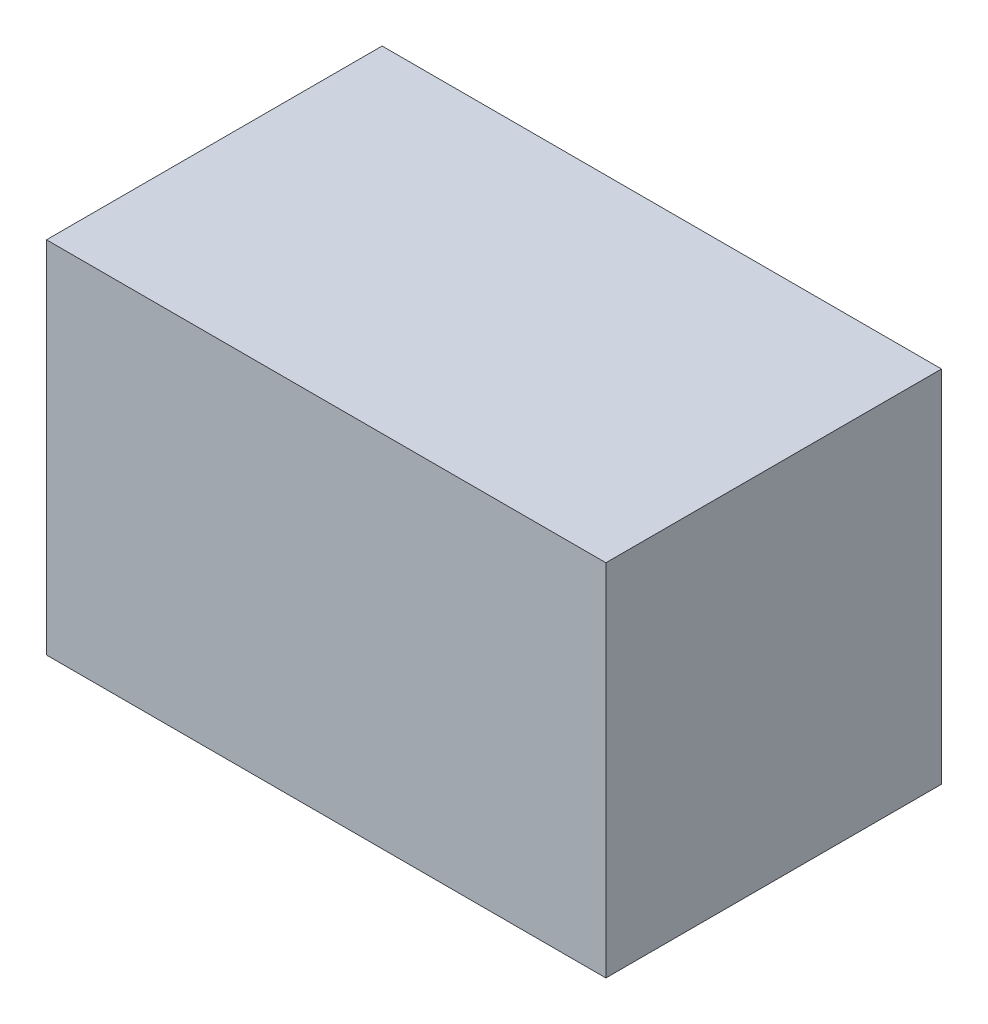
ISO-10303-21;
HEADER;
FILE_DESCRIPTION(('STEP AP214'),'2;1');
FILE_NAME('part.step','',(''),(''),'','','');
FILE_SCHEMA(('AUTOMOTIVE_DESIGN { 1 0 10303 214 1 1 1 1 }'));
ENDSEC;
DATA;
#1=APPLICATION_CONTEXT('core data for automotive mechanical design processes');
#2=APPLICATION_PROTOCOL_DEFINITION('international standard','automotive_design',2000,#1);
#3=PRODUCT_CONTEXT('',#1,'mechanical');
#4=PRODUCT('Part','Part','',(#3));
#5=PRODUCT_RELATED_PRODUCT_CATEGORY('part','',(#4));
#6=PRODUCT_DEFINITION_FORMATION('','',#4);
#7=PRODUCT_DEFINITION_CONTEXT('part definition',#1,'design');
#8=PRODUCT_DEFINITION('design','',#6,#7);
#9=PRODUCT_DEFINITION_SHAPE('','',#8);
#10=(LENGTH_UNIT() NAMED_UNIT(*) SI_UNIT(.MILLI.,.METRE.));
#11=(NAMED_UNIT(*) PLANE_ANGLE_UNIT() SI_UNIT($,.RADIAN.));
#12=(NAMED_UNIT(*) SI_UNIT($,.STERADIAN.) SOLID_ANGLE_UNIT());
#13=UNCERTAINTY_MEASURE_WITH_UNIT(LENGTH_MEASURE(1.E-05),#10,'distance_accuracy_value','');
#14=(GEOMETRIC_REPRESENTATION_CONTEXT(3) GLOBAL_UNCERTAINTY_ASSIGNED_CONTEXT((#13)) GLOBAL_UNIT_ASSIGNED_CONTEXT((#10,
#11,#12)) REPRESENTATION_CONTEXT('',''));
#15=CARTESIAN_POINT('',(0.,0.,0.));
#16=DIRECTION('',(0.,0.,1.));
#17=DIRECTION('',(1.,0.,0.));
#18=AXIS2_PLACEMENT_3D('',#15,#16,#17);
#19=CARTESIAN_POINT('',(-1.05000044,-0.67499992,1.26));
#20=DIRECTION('',(0.,0.,1.));
#21=DIRECTION('',(1.,0.,0.));
#22=AXIS2_PLACEMENT_3D('',#19,#20,#21);
#23=PLANE('',#22);
#24=DIRECTION('',(1.,0.,0.));
#25=VECTOR('',#24,1.);
#26=CARTESIAN_POINT('',(-1.05000044,0.67499992,1.26));
#27=LINE('',#26,#25);
#28=CARTESIAN_POINT('',(-1.05000044,0.67499992,1.26));
#29=VERTEX_POINT('',#28);
#30=CARTESIAN_POINT('',(1.05000044,0.67499992,1.26));
#31=VERTEX_POINT('',#30);
#32=EDGE_CURVE('E53',#29,#31,#27,.T.);
#33=ORIENTED_EDGE('',*,*,#32,.F.);
#34=DIRECTION('',(0.,1.,0.));
#35=VECTOR('',#34,1.);
#36=CARTESIAN_POINT('',(-1.05000044,-0.67499992,1.26));
#37=LINE('',#36,#35);
#38=CARTESIAN_POINT('',(-1.05000044,-0.67499992,1.26));
#39=VERTEX_POINT('',#38);
#40=EDGE_CURVE('E20',#29,#39,#37,.F.);
#41=ORIENTED_EDGE('',*,*,#40,.T.);
#42=DIRECTION('',(1.,0.,0.));
#43=VECTOR('',#42,1.);
#44=CARTESIAN_POINT('',(1.05000044,-0.67499992,1.26));
#45=LINE('',#44,#43);
#46=CARTESIAN_POINT('',(1.05000044,-0.67499992,1.26));
#47=VERTEX_POINT('',#46);
#48=EDGE_CURVE('E67',#47,#39,#45,.F.);
#49=ORIENTED_EDGE('',*,*,#48,.F.);
#50=DIRECTION('',(0.,1.,0.));
#51=VECTOR('',#50,1.);
#52=CARTESIAN_POINT('',(1.05000044,0.67499992,1.26));
#53=LINE('',#52,#51);
#54=EDGE_CURVE('E58',#31,#47,#53,.F.);
#55=ORIENTED_EDGE('',*,*,#54,.F.);
#56=EDGE_LOOP('',(#33,#41,#49,#55));
#57=FACE_BOUND('',#56,.T.);
#58=ADVANCED_FACE('F17',(#57),#23,.T.);
#59=CARTESIAN_POINT('',(1.05000044,-0.67499992,0.));
#60=DIRECTION('',(0.,-1.,0.));
#61=DIRECTION('',(0.,0.,-1.));
#62=AXIS2_PLACEMENT_3D('',#59,#60,#61);
#63=PLANE('',#62);
#64=DIRECTION('',(0.,0.,1.));
#65=VECTOR('',#64,1.);
#66=CARTESIAN_POINT('',(-1.05000044,-0.67499992,0.));
#67=LINE('',#66,#65);
#68=CARTESIAN_POINT('',(-1.05000044,-0.67499992,0.));
#69=VERTEX_POINT('',#68);
#70=EDGE_CURVE('E80',#69,#39,#67,.T.);
#71=ORIENTED_EDGE('',*,*,#70,.F.);
#72=DIRECTION('',(1.,0.,0.));
#73=VECTOR('',#72,1.);
#74=CARTESIAN_POINT('',(-1.05000044,-0.67499992,0.));
#75=LINE('',#74,#73);
#76=CARTESIAN_POINT('',(1.05000044,-0.67499992,0.));
#77=VERTEX_POINT('',#76);
#78=EDGE_CURVE('E75',#69,#77,#75,.T.);
#79=ORIENTED_EDGE('',*,*,#78,.T.);
#80=DIRECTION('',(0.,0.,-1.));
#81=VECTOR('',#80,1.);
#82=CARTESIAN_POINT('',(1.05000044,-0.67499992,0.));
#83=LINE('',#82,#81);
#84=EDGE_CURVE('E63',#47,#77,#83,.T.);
#85=ORIENTED_EDGE('',*,*,#84,.F.);
#86=ORIENTED_EDGE('',*,*,#48,.T.);
#87=EDGE_LOOP('',(#71,#79,#85,#86));
#88=FACE_BOUND('',#87,.T.);
#89=ADVANCED_FACE('F74',(#88),#63,.T.);
#90=CARTESIAN_POINT('',(1.05000044,0.67499992,0.));
#91=DIRECTION('',(1.,0.,0.));
#92=DIRECTION('',(0.,0.,-1.));
#93=AXIS2_PLACEMENT_3D('',#90,#91,#92);
#94=PLANE('',#93);
#95=ORIENTED_EDGE('',*,*,#84,.T.);
#96=DIRECTION('',(0.,1.,0.));
#97=VECTOR('',#96,1.);
#98=CARTESIAN_POINT('',(1.05000044,-0.67499992,0.));
#99=LINE('',#98,#97);
#100=CARTESIAN_POINT('',(1.05000044,0.67499992,0.));
#101=VERTEX_POINT('',#100);
#102=EDGE_CURVE('E84',#77,#101,#99,.T.);
#103=ORIENTED_EDGE('',*,*,#102,.T.);
#104=DIRECTION('',(0.,0.,1.));
#105=VECTOR('',#104,1.);
#106=CARTESIAN_POINT('',(1.05000044,0.67499992,0.));
#107=LINE('',#106,#105);
#108=EDGE_CURVE('E65',#31,#101,#107,.F.);
#109=ORIENTED_EDGE('',*,*,#108,.F.);
#110=ORIENTED_EDGE('',*,*,#54,.T.);
#111=EDGE_LOOP('',(#95,#103,#109,#110));
#112=FACE_BOUND('',#111,.T.);
#113=ADVANCED_FACE('F60',(#112),#94,.T.);
#114=CARTESIAN_POINT('',(-1.05000044,0.67499992,0.));
#115=DIRECTION('',(0.,1.,0.));
#116=DIRECTION('',(0.,0.,1.));
#117=AXIS2_PLACEMENT_3D('',#114,#115,#116);
#118=PLANE('',#117);
#119=ORIENTED_EDGE('',*,*,#108,.T.);
#120=DIRECTION('',(1.,0.,0.));
#121=VECTOR('',#120,1.);
#122=CARTESIAN_POINT('',(-1.05000044,0.67499992,0.));
#123=LINE('',#122,#121);
#124=CARTESIAN_POINT('',(-1.05000044,0.67499992,0.));
#125=VERTEX_POINT('',#124);
#126=EDGE_CURVE('E26',#101,#125,#123,.F.);
#127=ORIENTED_EDGE('',*,*,#126,.T.);
#128=DIRECTION('',(0.,0.,1.));
#129=VECTOR('',#128,1.);
#130=CARTESIAN_POINT('',(-1.05000044,0.67499992,0.));
#131=LINE('',#130,#129);
#132=EDGE_CURVE('E34',#29,#125,#131,.F.);
#133=ORIENTED_EDGE('',*,*,#132,.F.);
#134=ORIENTED_EDGE('',*,*,#32,.T.);
#135=EDGE_LOOP('',(#119,#127,#133,#134));
#136=FACE_BOUND('',#135,.T.);
#137=ADVANCED_FACE('F88',(#136),#118,.T.);
#138=CARTESIAN_POINT('',(-1.05000044,-0.67499992,0.));
#139=DIRECTION('',(-1.,0.,0.));
#140=DIRECTION('',(0.,0.,1.));
#141=AXIS2_PLACEMENT_3D('',#138,#139,#140);
#142=PLANE('',#141);
#143=ORIENTED_EDGE('',*,*,#132,.T.);
#144=DIRECTION('',(0.,1.,0.));
#145=VECTOR('',#144,1.);
#146=CARTESIAN_POINT('',(-1.05000044,-0.67499992,0.));
#147=LINE('',#146,#145);
#148=EDGE_CURVE('E11',#125,#69,#147,.F.);
#149=ORIENTED_EDGE('',*,*,#148,.T.);
#150=ORIENTED_EDGE('',*,*,#70,.T.);
#151=ORIENTED_EDGE('',*,*,#40,.F.);
#152=EDGE_LOOP('',(#143,#149,#150,#151));
#153=FACE_BOUND('',#152,.T.);
#154=ADVANCED_FACE('F91',(#153),#142,.T.);
#155=CARTESIAN_POINT('',(-1.05000044,-0.67499992,0.));
#156=DIRECTION('',(0.,0.,1.));
#157=DIRECTION('',(1.,0.,0.));
#158=AXIS2_PLACEMENT_3D('',#155,#156,#157);
#159=PLANE('',#158);
#160=ORIENTED_EDGE('',*,*,#126,.F.);
#161=ORIENTED_EDGE('',*,*,#102,.F.);
#162=ORIENTED_EDGE('',*,*,#78,.F.);
#163=ORIENTED_EDGE('',*,*,#148,.F.);
#164=EDGE_LOOP('',(#160,#161,#162,#163));
#165=FACE_BOUND('',#164,.T.);
#166=ADVANCED_FACE('F90',(#165),#159,.F.);
#167=CLOSED_SHELL('',(#58,#89,#113,#137,#154,#166));
#168=MANIFOLD_SOLID_BREP('B1',#167);
#169=ADVANCED_BREP_SHAPE_REPRESENTATION('',(#18,#168),#14);
#170=SHAPE_DEFINITION_REPRESENTATION(#9,#169);
ENDSEC;
END-ISO-10303-21;
